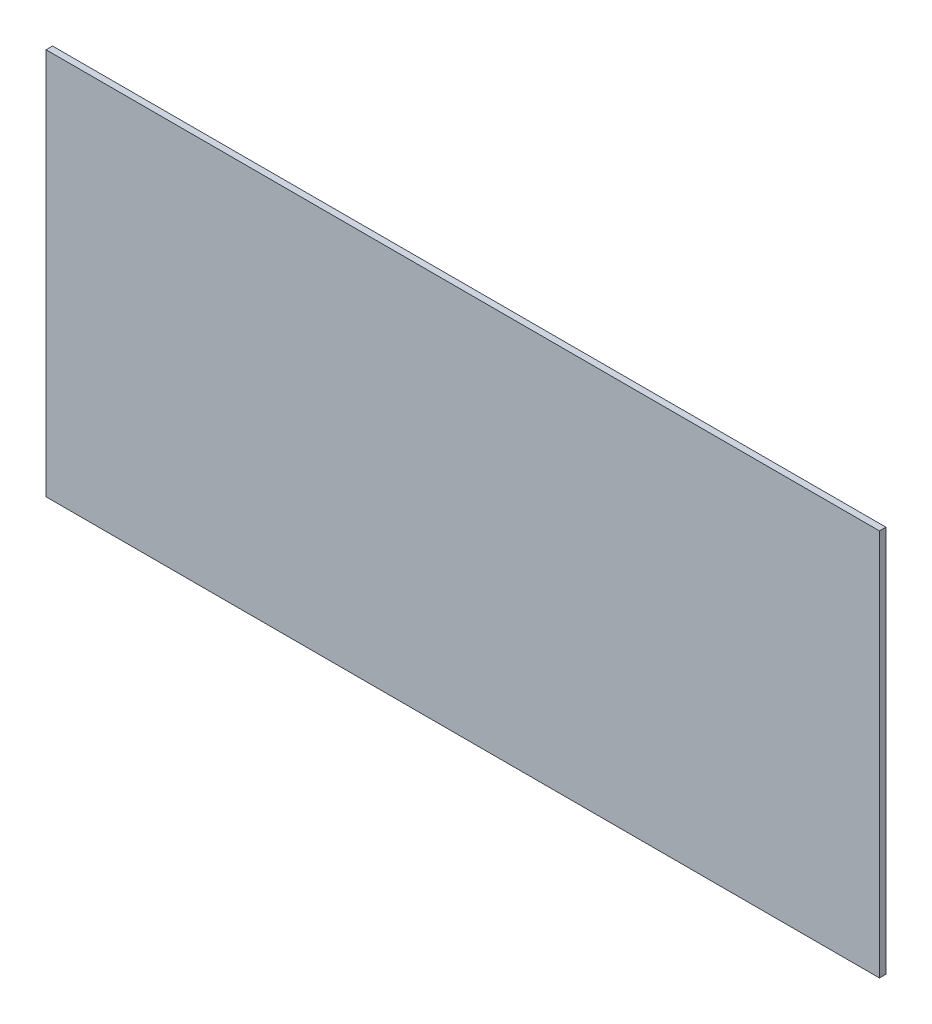
ISO-10303-21;
HEADER;
FILE_DESCRIPTION(('STEP AP214'),'2;1');
FILE_NAME('part.step','',(''),(''),'','','');
FILE_SCHEMA(('AUTOMOTIVE_DESIGN { 1 0 10303 214 1 1 1 1 }'));
ENDSEC;
DATA;
#1=APPLICATION_CONTEXT('core data for automotive mechanical design processes');
#2=APPLICATION_PROTOCOL_DEFINITION('international standard','automotive_design',2000,#1);
#3=PRODUCT_CONTEXT('',#1,'mechanical');
#4=PRODUCT('Part','Part','',(#3));
#5=PRODUCT_RELATED_PRODUCT_CATEGORY('part','',(#4));
#6=PRODUCT_DEFINITION_FORMATION('','',#4);
#7=PRODUCT_DEFINITION_CONTEXT('part definition',#1,'design');
#8=PRODUCT_DEFINITION('design','',#6,#7);
#9=PRODUCT_DEFINITION_SHAPE('','',#8);
#10=(LENGTH_UNIT() NAMED_UNIT(*) SI_UNIT(.MILLI.,.METRE.));
#11=(NAMED_UNIT(*) PLANE_ANGLE_UNIT() SI_UNIT($,.RADIAN.));
#12=(NAMED_UNIT(*) SI_UNIT($,.STERADIAN.) SOLID_ANGLE_UNIT());
#13=UNCERTAINTY_MEASURE_WITH_UNIT(LENGTH_MEASURE(1.E-05),#10,'distance_accuracy_value','');
#14=(GEOMETRIC_REPRESENTATION_CONTEXT(3) GLOBAL_UNCERTAINTY_ASSIGNED_CONTEXT((#13)) GLOBAL_UNIT_ASSIGNED_CONTEXT((#10,
#11,#12)) REPRESENTATION_CONTEXT('',''));
#15=CARTESIAN_POINT('',(0.,0.,0.));
#16=DIRECTION('',(0.,0.,1.));
#17=DIRECTION('',(1.,0.,0.));
#18=AXIS2_PLACEMENT_3D('',#15,#16,#17);
#19=CARTESIAN_POINT('',(289.5,-134.5,2.2479));
#20=DIRECTION('',(-1.,0.,0.));
#21=DIRECTION('',(0.,0.,1.));
#22=AXIS2_PLACEMENT_3D('',#19,#20,#21);
#23=PLANE('',#22);
#24=DIRECTION('',(0.,1.,0.));
#25=VECTOR('',#24,1.);
#26=CARTESIAN_POINT('',(289.5,-134.5,-2.2479));
#27=LINE('',#26,#25);
#28=CARTESIAN_POINT('',(289.5,-134.5,-2.2479));
#29=VERTEX_POINT('',#28);
#30=CARTESIAN_POINT('',(289.5,134.5,-2.2479));
#31=VERTEX_POINT('',#30);
#32=EDGE_CURVE('E97',#29,#31,#27,.T.);
#33=ORIENTED_EDGE('',*,*,#32,.T.);
#34=DIRECTION('',(0.,0.,-1.));
#35=VECTOR('',#34,1.);
#36=CARTESIAN_POINT('',(289.5,134.5,2.2479));
#37=LINE('',#36,#35);
#38=CARTESIAN_POINT('',(289.5,134.5,2.2479));
#39=VERTEX_POINT('',#38);
#40=EDGE_CURVE('E11',#39,#31,#37,.T.);
#41=ORIENTED_EDGE('',*,*,#40,.F.);
#42=DIRECTION('',(0.,1.,0.));
#43=VECTOR('',#42,1.);
#44=CARTESIAN_POINT('',(289.5,-134.5,2.2479));
#45=LINE('',#44,#43);
#46=CARTESIAN_POINT('',(289.5,-134.5,2.2479));
#47=VERTEX_POINT('',#46);
#48=EDGE_CURVE('E85',#47,#39,#45,.T.);
#49=ORIENTED_EDGE('',*,*,#48,.F.);
#50=DIRECTION('',(0.,0.,-1.));
#51=VECTOR('',#50,1.);
#52=CARTESIAN_POINT('',(289.5,-134.5,2.2479));
#53=LINE('',#52,#51);
#54=EDGE_CURVE('E93',#47,#29,#53,.T.);
#55=ORIENTED_EDGE('',*,*,#54,.T.);
#56=EDGE_LOOP('',(#33,#41,#49,#55));
#57=FACE_BOUND('',#56,.T.);
#58=ADVANCED_FACE('F34',(#57),#23,.F.);
#59=CARTESIAN_POINT('',(-289.5,134.5,2.2479));
#60=DIRECTION('',(0.,-1.,0.));
#61=DIRECTION('',(0.,0.,-1.));
#62=AXIS2_PLACEMENT_3D('',#59,#60,#61);
#63=PLANE('',#62);
#64=DIRECTION('',(-1.,0.,0.));
#65=VECTOR('',#64,1.);
#66=CARTESIAN_POINT('',(-289.5,134.5,-2.2479));
#67=LINE('',#66,#65);
#68=CARTESIAN_POINT('',(-289.5,134.5,-2.2479));
#69=VERTEX_POINT('',#68);
#70=EDGE_CURVE('E89',#31,#69,#67,.T.);
#71=ORIENTED_EDGE('',*,*,#70,.T.);
#72=DIRECTION('',(0.,0.,-1.));
#73=VECTOR('',#72,1.);
#74=CARTESIAN_POINT('',(-289.5,134.5,2.2479));
#75=LINE('',#74,#73);
#76=CARTESIAN_POINT('',(-289.5,134.5,2.2479));
#77=VERTEX_POINT('',#76);
#78=EDGE_CURVE('E42',#77,#69,#75,.T.);
#79=ORIENTED_EDGE('',*,*,#78,.F.);
#80=DIRECTION('',(-1.,0.,0.));
#81=VECTOR('',#80,1.);
#82=CARTESIAN_POINT('',(-289.5,134.5,2.2479));
#83=LINE('',#82,#81);
#84=EDGE_CURVE('E80',#39,#77,#83,.T.);
#85=ORIENTED_EDGE('',*,*,#84,.F.);
#86=ORIENTED_EDGE('',*,*,#40,.T.);
#87=EDGE_LOOP('',(#71,#79,#85,#86));
#88=FACE_BOUND('',#87,.T.);
#89=ADVANCED_FACE('F88',(#88),#63,.F.);
#90=CARTESIAN_POINT('',(-289.5,-134.5,2.2479));
#91=DIRECTION('',(1.,0.,0.));
#92=DIRECTION('',(0.,0.,-1.));
#93=AXIS2_PLACEMENT_3D('',#90,#91,#92);
#94=PLANE('',#93);
#95=DIRECTION('',(0.,-1.,0.));
#96=VECTOR('',#95,1.);
#97=CARTESIAN_POINT('',(-289.5,-134.5,-2.2479));
#98=LINE('',#97,#96);
#99=CARTESIAN_POINT('',(-289.5,-134.5,-2.2479));
#100=VERTEX_POINT('',#99);
#101=EDGE_CURVE('E67',#69,#100,#98,.T.);
#102=ORIENTED_EDGE('',*,*,#101,.T.);
#103=DIRECTION('',(0.,0.,-1.));
#104=VECTOR('',#103,1.);
#105=CARTESIAN_POINT('',(-289.5,-134.5,2.2479));
#106=LINE('',#105,#104);
#107=CARTESIAN_POINT('',(-289.5,-134.5,2.2479));
#108=VERTEX_POINT('',#107);
#109=EDGE_CURVE('E90',#108,#100,#106,.T.);
#110=ORIENTED_EDGE('',*,*,#109,.F.);
#111=DIRECTION('',(0.,-1.,0.));
#112=VECTOR('',#111,1.);
#113=CARTESIAN_POINT('',(-289.5,-134.5,2.2479));
#114=LINE('',#113,#112);
#115=EDGE_CURVE('E83',#77,#108,#114,.T.);
#116=ORIENTED_EDGE('',*,*,#115,.F.);
#117=ORIENTED_EDGE('',*,*,#78,.T.);
#118=EDGE_LOOP('',(#102,#110,#116,#117));
#119=FACE_BOUND('',#118,.T.);
#120=ADVANCED_FACE('F91',(#119),#94,.F.);
#121=CARTESIAN_POINT('',(-289.5,-134.5,2.2479));
#122=DIRECTION('',(0.,1.,0.));
#123=DIRECTION('',(0.,0.,1.));
#124=AXIS2_PLACEMENT_3D('',#121,#122,#123);
#125=PLANE('',#124);
#126=DIRECTION('',(1.,0.,0.));
#127=VECTOR('',#126,1.);
#128=CARTESIAN_POINT('',(-289.5,-134.5,-2.2479));
#129=LINE('',#128,#127);
#130=EDGE_CURVE('E73',#100,#29,#129,.T.);
#131=ORIENTED_EDGE('',*,*,#130,.T.);
#132=ORIENTED_EDGE('',*,*,#54,.F.);
#133=DIRECTION('',(1.,0.,0.));
#134=VECTOR('',#133,1.);
#135=CARTESIAN_POINT('',(-289.5,-134.5,2.2479));
#136=LINE('',#135,#134);
#137=EDGE_CURVE('E50',#108,#47,#136,.T.);
#138=ORIENTED_EDGE('',*,*,#137,.F.);
#139=ORIENTED_EDGE('',*,*,#109,.T.);
#140=EDGE_LOOP('',(#131,#132,#138,#139));
#141=FACE_BOUND('',#140,.T.);
#142=ADVANCED_FACE('F104',(#141),#125,.F.);
#143=CARTESIAN_POINT('',(0.,0.,2.2479));
#144=DIRECTION('',(0.,0.,-1.));
#145=DIRECTION('',(-1.,0.,0.));
#146=AXIS2_PLACEMENT_3D('',#143,#144,#145);
#147=PLANE('',#146);
#148=ORIENTED_EDGE('',*,*,#48,.T.);
#149=ORIENTED_EDGE('',*,*,#84,.T.);
#150=ORIENTED_EDGE('',*,*,#115,.T.);
#151=ORIENTED_EDGE('',*,*,#137,.T.);
#152=EDGE_LOOP('',(#148,#149,#150,#151));
#153=FACE_BOUND('',#152,.T.);
#154=ADVANCED_FACE('F81',(#153),#147,.F.);
#155=CARTESIAN_POINT('',(0.,0.,-2.2479));
#156=DIRECTION('',(0.,0.,-1.));
#157=DIRECTION('',(-1.,0.,0.));
#158=AXIS2_PLACEMENT_3D('',#155,#156,#157);
#159=PLANE('',#158);
#160=ORIENTED_EDGE('',*,*,#32,.F.);
#161=ORIENTED_EDGE('',*,*,#130,.F.);
#162=ORIENTED_EDGE('',*,*,#101,.F.);
#163=ORIENTED_EDGE('',*,*,#70,.F.);
#164=EDGE_LOOP('',(#160,#161,#162,#163));
#165=FACE_BOUND('',#164,.T.);
#166=ADVANCED_FACE('F107',(#165),#159,.T.);
#167=CLOSED_SHELL('',(#58,#89,#120,#142,#154,#166));
#168=MANIFOLD_SOLID_BREP('B2',#167);
#169=ADVANCED_BREP_SHAPE_REPRESENTATION('',(#18,#168),#14);
#170=SHAPE_DEFINITION_REPRESENTATION(#9,#169);
ENDSEC;
END-ISO-10303-21;
